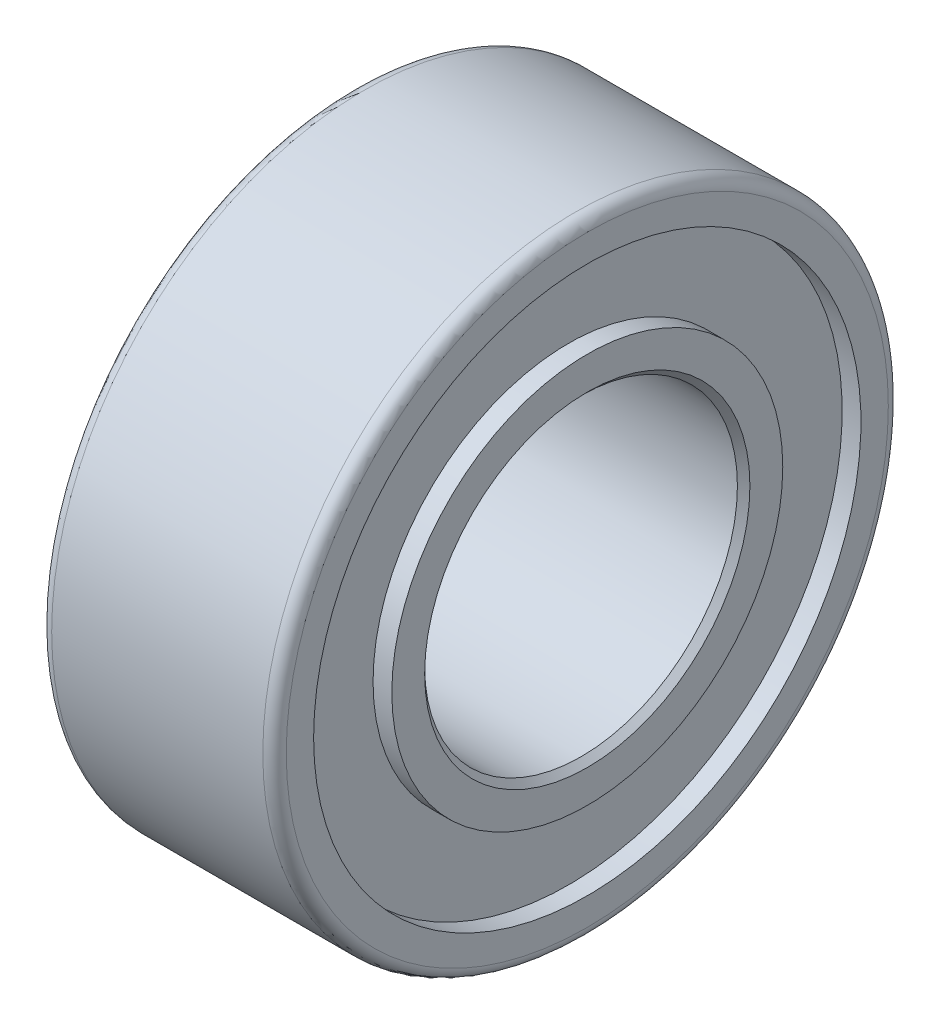
ISO-10303-21;
HEADER;
FILE_DESCRIPTION(('STEP AP214'),'2;1');
FILE_NAME('part.step','',(''),(''),'','','');
FILE_SCHEMA(('AUTOMOTIVE_DESIGN { 1 0 10303 214 1 1 1 1 }'));
ENDSEC;
DATA;
#1=APPLICATION_CONTEXT('core data for automotive mechanical design processes');
#2=APPLICATION_PROTOCOL_DEFINITION('international standard','automotive_design',2000,#1);
#3=PRODUCT_CONTEXT('',#1,'mechanical');
#4=PRODUCT('Part','Part','',(#3));
#5=PRODUCT_RELATED_PRODUCT_CATEGORY('part','',(#4));
#6=PRODUCT_DEFINITION_FORMATION('','',#4);
#7=PRODUCT_DEFINITION_CONTEXT('part definition',#1,'design');
#8=PRODUCT_DEFINITION('design','',#6,#7);
#9=PRODUCT_DEFINITION_SHAPE('','',#8);
#10=(LENGTH_UNIT() NAMED_UNIT(*) SI_UNIT(.MILLI.,.METRE.));
#11=(NAMED_UNIT(*) PLANE_ANGLE_UNIT() SI_UNIT($,.RADIAN.));
#12=(NAMED_UNIT(*) SI_UNIT($,.STERADIAN.) SOLID_ANGLE_UNIT());
#13=UNCERTAINTY_MEASURE_WITH_UNIT(LENGTH_MEASURE(1.E-05),#10,'distance_accuracy_value','');
#14=(GEOMETRIC_REPRESENTATION_CONTEXT(3) GLOBAL_UNCERTAINTY_ASSIGNED_CONTEXT((#13)) GLOBAL_UNIT_ASSIGNED_CONTEXT((#10,
#11,#12)) REPRESENTATION_CONTEXT('',''));
#15=CARTESIAN_POINT('',(0.,0.,0.));
#16=DIRECTION('',(0.,0.,1.));
#17=DIRECTION('',(1.,0.,0.));
#18=AXIS2_PLACEMENT_3D('',#15,#16,#17);
#19=CARTESIAN_POINT('',(0.,0.,0.));
#20=DIRECTION('',(-1.,0.,0.));
#21=DIRECTION('',(0.,0.,1.));
#22=AXIS2_PLACEMENT_3D('',#19,#20,#21);
#23=CYLINDRICAL_SURFACE('',#22,3.175);
#24=CARTESIAN_POINT('',(-2.25424999996449,0.,0.));
#25=DIRECTION('',(-1.,0.,0.));
#26=DIRECTION('',(0.,0.,1.));
#27=AXIS2_PLACEMENT_3D('',#24,#25,#26);
#28=CIRCLE('',#27,3.17499999999882);
#29=CARTESIAN_POINT('',(-2.25424999996449,0.,3.17499999999882));
#30=VERTEX_POINT('',#29);
#31=EDGE_CURVE('E64',#30,#30,#28,.T.);
#32=ORIENTED_EDGE('',*,*,#31,.T.);
#33=EDGE_LOOP('',(#32));
#34=FACE_BOUND('',#33,.T.);
#35=CARTESIAN_POINT('',(2.25425000002133,0.,0.));
#36=DIRECTION('',(1.,0.,0.));
#37=DIRECTION('',(0.,0.,-1.));
#38=AXIS2_PLACEMENT_3D('',#35,#36,#37);
#39=CIRCLE('',#38,3.17500000005566);
#40=CARTESIAN_POINT('',(2.25425000002133,0.,-3.17500000005566));
#41=VERTEX_POINT('',#40);
#42=EDGE_CURVE('E296',#41,#41,#39,.T.);
#43=ORIENTED_EDGE('',*,*,#42,.T.);
#44=EDGE_LOOP('',(#43));
#45=FACE_BOUND('',#44,.T.);
#46=ADVANCED_FACE('F16',(#34,#45),#23,.F.);
#47=CARTESIAN_POINT('',(2.38125000004175,0.,0.));
#48=DIRECTION('',(1.,0.,0.));
#49=DIRECTION('',(0.,0.,-1.));
#50=AXIS2_PLACEMENT_3D('',#47,#48,#49);
#51=CONICAL_SURFACE('',#50,3.30200000001923,0.785398163173655);
#52=CARTESIAN_POINT('',(2.38125000004175,0.,0.));
#53=DIRECTION('',(1.,0.,0.));
#54=DIRECTION('',(0.,0.,-1.));
#55=AXIS2_PLACEMENT_3D('',#52,#53,#54);
#56=CIRCLE('',#55,3.30200000001923);
#57=CARTESIAN_POINT('',(2.38125000004175,0.,-3.30200000001923));
#58=VERTEX_POINT('',#57);
#59=EDGE_CURVE('E318',#58,#58,#56,.T.);
#60=ORIENTED_EDGE('',*,*,#59,.T.);
#61=EDGE_LOOP('',(#60));
#62=FACE_BOUND('',#61,.T.);
#63=ORIENTED_EDGE('',*,*,#42,.F.);
#64=EDGE_LOOP('',(#63));
#65=FACE_BOUND('',#64,.T.);
#66=ADVANCED_FACE('F160',(#62,#65),#51,.F.);
#67=CARTESIAN_POINT('',(-2.38124999992806,0.,0.));
#68=DIRECTION('',(-1.,0.,0.));
#69=DIRECTION('',(0.,0.,1.));
#70=AXIS2_PLACEMENT_3D('',#67,#68,#69);
#71=CONICAL_SURFACE('',#70,3.30199999990555,0.785398163397448);
#72=CARTESIAN_POINT('',(-2.3812499999849,0.,0.));
#73=DIRECTION('',(-1.,0.,0.));
#74=DIRECTION('',(0.,0.,1.));
#75=AXIS2_PLACEMENT_3D('',#72,#73,#74);
#76=CIRCLE('',#75,3.30199999996239);
#77=CARTESIAN_POINT('',(-2.3812499999849,0.,3.30199999996239));
#78=VERTEX_POINT('',#77);
#79=EDGE_CURVE('E315',#78,#78,#76,.T.);
#80=ORIENTED_EDGE('',*,*,#79,.T.);
#81=EDGE_LOOP('',(#80));
#82=FACE_BOUND('',#81,.T.);
#83=ORIENTED_EDGE('',*,*,#31,.F.);
#84=EDGE_LOOP('',(#83));
#85=FACE_BOUND('',#84,.T.);
#86=ADVANCED_FACE('F157',(#82,#85),#71,.F.);
#87=CARTESIAN_POINT('',(2.38125,3.175,0.));
#88=DIRECTION('',(-1.,0.,0.));
#89=DIRECTION('',(0.,0.,1.));
#90=AXIS2_PLACEMENT_3D('',#87,#88,#89);
#91=PLANE('',#90);
#92=CARTESIAN_POINT('',(2.38125,0.,0.));
#93=DIRECTION('',(-1.,0.,0.));
#94=DIRECTION('',(0.,0.,1.));
#95=AXIS2_PLACEMENT_3D('',#92,#93,#94);
#96=CIRCLE('',#95,3.96875);
#97=CARTESIAN_POINT('',(2.38125,0.,3.96875));
#98=VERTEX_POINT('',#97);
#99=EDGE_CURVE('E312',#98,#98,#96,.T.);
#100=ORIENTED_EDGE('',*,*,#99,.F.);
#101=EDGE_LOOP('',(#100));
#102=FACE_BOUND('',#101,.T.);
#103=ORIENTED_EDGE('',*,*,#59,.F.);
#104=EDGE_LOOP('',(#103));
#105=FACE_BOUND('',#104,.T.);
#106=ADVANCED_FACE('F153',(#102,#105),#91,.F.);
#107=CARTESIAN_POINT('',(-2.38125,3.96875,0.));
#108=DIRECTION('',(1.,0.,0.));
#109=DIRECTION('',(0.,0.,-1.));
#110=AXIS2_PLACEMENT_3D('',#107,#108,#109);
#111=PLANE('',#110);
#112=CARTESIAN_POINT('',(-2.38125,0.,0.));
#113=DIRECTION('',(-1.,0.,0.));
#114=DIRECTION('',(0.,0.,1.));
#115=AXIS2_PLACEMENT_3D('',#112,#113,#114);
#116=CIRCLE('',#115,3.96875);
#117=CARTESIAN_POINT('',(-2.38125,0.,3.96875));
#118=VERTEX_POINT('',#117);
#119=EDGE_CURVE('E309',#118,#118,#116,.F.);
#120=ORIENTED_EDGE('',*,*,#119,.F.);
#121=EDGE_LOOP('',(#120));
#122=FACE_BOUND('',#121,.T.);
#123=ORIENTED_EDGE('',*,*,#79,.F.);
#124=EDGE_LOOP('',(#123));
#125=FACE_BOUND('',#124,.T.);
#126=ADVANCED_FACE('F149',(#122,#125),#111,.F.);
#127=CARTESIAN_POINT('',(0.,0.,0.));
#128=DIRECTION('',(-1.,0.,0.));
#129=DIRECTION('',(0.,0.,1.));
#130=AXIS2_PLACEMENT_3D('',#127,#128,#129);
#131=CYLINDRICAL_SURFACE('',#130,3.96875);
#132=CARTESIAN_POINT('',(2.00025,0.,0.));
#133=DIRECTION('',(-1.,0.,0.));
#134=DIRECTION('',(0.,0.,1.));
#135=AXIS2_PLACEMENT_3D('',#132,#133,#134);
#136=CIRCLE('',#135,3.96875);
#137=CARTESIAN_POINT('',(2.00025,0.,3.96875));
#138=VERTEX_POINT('',#137);
#139=EDGE_CURVE('E306',#138,#138,#136,.F.);
#140=ORIENTED_EDGE('',*,*,#139,.T.);
#141=EDGE_LOOP('',(#140));
#142=FACE_BOUND('',#141,.T.);
#143=ORIENTED_EDGE('',*,*,#99,.T.);
#144=EDGE_LOOP('',(#143));
#145=FACE_BOUND('',#144,.T.);
#146=ADVANCED_FACE('F145',(#142,#145),#131,.T.);
#147=CARTESIAN_POINT('',(0.,0.,0.));
#148=DIRECTION('',(-1.,0.,0.));
#149=DIRECTION('',(0.,0.,1.));
#150=AXIS2_PLACEMENT_3D('',#147,#148,#149);
#151=CYLINDRICAL_SURFACE('',#150,3.96875);
#152=ORIENTED_EDGE('',*,*,#119,.T.);
#153=EDGE_LOOP('',(#152));
#154=FACE_BOUND('',#153,.T.);
#155=CARTESIAN_POINT('',(-2.00025,0.,0.));
#156=DIRECTION('',(-1.,0.,0.));
#157=DIRECTION('',(0.,0.,1.));
#158=AXIS2_PLACEMENT_3D('',#155,#156,#157);
#159=CIRCLE('',#158,3.96875);
#160=CARTESIAN_POINT('',(-2.00025,0.,3.96875));
#161=VERTEX_POINT('',#160);
#162=EDGE_CURVE('E303',#161,#161,#159,.T.);
#163=ORIENTED_EDGE('',*,*,#162,.T.);
#164=EDGE_LOOP('',(#163));
#165=FACE_BOUND('',#164,.T.);
#166=ADVANCED_FACE('F141',(#154,#165),#151,.T.);
#167=CARTESIAN_POINT('',(2.00025,3.96875,0.));
#168=DIRECTION('',(-1.,0.,0.));
#169=DIRECTION('',(0.,0.,1.));
#170=AXIS2_PLACEMENT_3D('',#167,#168,#169);
#171=PLANE('',#170);
#172=ORIENTED_EDGE('',*,*,#139,.F.);
#173=EDGE_LOOP('',(#172));
#174=FACE_BOUND('',#173,.T.);
#175=CARTESIAN_POINT('',(2.00025,0.,0.));
#176=DIRECTION('',(-1.,0.,0.));
#177=DIRECTION('',(0.,0.,1.));
#178=AXIS2_PLACEMENT_3D('',#175,#176,#177);
#179=CIRCLE('',#178,5.55625);
#180=CARTESIAN_POINT('',(2.00025,0.,5.55625));
#181=VERTEX_POINT('',#180);
#182=EDGE_CURVE('E300',#181,#181,#179,.F.);
#183=ORIENTED_EDGE('',*,*,#182,.T.);
#184=EDGE_LOOP('',(#183));
#185=FACE_BOUND('',#184,.T.);
#186=ADVANCED_FACE('F137',(#174,#185),#171,.F.);
#187=CARTESIAN_POINT('',(-2.00025,5.55625,0.));
#188=DIRECTION('',(1.,0.,0.));
#189=DIRECTION('',(0.,0.,-1.));
#190=AXIS2_PLACEMENT_3D('',#187,#188,#189);
#191=PLANE('',#190);
#192=CARTESIAN_POINT('',(-2.00025,0.,0.));
#193=DIRECTION('',(-1.,0.,0.));
#194=DIRECTION('',(0.,0.,1.));
#195=AXIS2_PLACEMENT_3D('',#192,#193,#194);
#196=CIRCLE('',#195,5.55625);
#197=CARTESIAN_POINT('',(-2.00025,0.,5.55625));
#198=VERTEX_POINT('',#197);
#199=EDGE_CURVE('E294',#198,#198,#196,.T.);
#200=ORIENTED_EDGE('',*,*,#199,.T.);
#201=EDGE_LOOP('',(#200));
#202=FACE_BOUND('',#201,.T.);
#203=ORIENTED_EDGE('',*,*,#162,.F.);
#204=EDGE_LOOP('',(#203));
#205=FACE_BOUND('',#204,.T.);
#206=ADVANCED_FACE('F133',(#202,#205),#191,.F.);
#207=CARTESIAN_POINT('',(0.,0.,0.));
#208=DIRECTION('',(-1.,0.,0.));
#209=DIRECTION('',(0.,0.,1.));
#210=AXIS2_PLACEMENT_3D('',#207,#208,#209);
#211=CYLINDRICAL_SURFACE('',#210,5.55625);
#212=CARTESIAN_POINT('',(2.38125,0.,0.));
#213=DIRECTION('',(-1.,0.,0.));
#214=DIRECTION('',(0.,0.,1.));
#215=AXIS2_PLACEMENT_3D('',#212,#213,#214);
#216=CIRCLE('',#215,5.55625);
#217=CARTESIAN_POINT('',(2.38125,0.,5.55625));
#218=VERTEX_POINT('',#217);
#219=EDGE_CURVE('E291',#218,#218,#216,.F.);
#220=ORIENTED_EDGE('',*,*,#219,.T.);
#221=EDGE_LOOP('',(#220));
#222=FACE_BOUND('',#221,.T.);
#223=ORIENTED_EDGE('',*,*,#182,.F.);
#224=EDGE_LOOP('',(#223));
#225=FACE_BOUND('',#224,.T.);
#226=ADVANCED_FACE('F129',(#222,#225),#211,.F.);
#227=CARTESIAN_POINT('',(0.,0.,0.));
#228=DIRECTION('',(-1.,0.,0.));
#229=DIRECTION('',(0.,0.,1.));
#230=AXIS2_PLACEMENT_3D('',#227,#228,#229);
#231=CYLINDRICAL_SURFACE('',#230,5.55625);
#232=ORIENTED_EDGE('',*,*,#199,.F.);
#233=EDGE_LOOP('',(#232));
#234=FACE_BOUND('',#233,.T.);
#235=CARTESIAN_POINT('',(-2.38125,0.,0.));
#236=DIRECTION('',(-1.,0.,0.));
#237=DIRECTION('',(0.,0.,1.));
#238=AXIS2_PLACEMENT_3D('',#235,#236,#237);
#239=CIRCLE('',#238,5.55625);
#240=CARTESIAN_POINT('',(-2.38125,0.,5.55625));
#241=VERTEX_POINT('',#240);
#242=EDGE_CURVE('E51',#241,#241,#239,.T.);
#243=ORIENTED_EDGE('',*,*,#242,.T.);
#244=EDGE_LOOP('',(#243));
#245=FACE_BOUND('',#244,.T.);
#246=ADVANCED_FACE('F124',(#234,#245),#231,.F.);
#247=CARTESIAN_POINT('',(2.38125,5.55625,0.));
#248=DIRECTION('',(-1.,0.,0.));
#249=DIRECTION('',(0.,0.,1.));
#250=AXIS2_PLACEMENT_3D('',#247,#248,#249);
#251=PLANE('',#250);
#252=ORIENTED_EDGE('',*,*,#219,.F.);
#253=EDGE_LOOP('',(#252));
#254=FACE_BOUND('',#253,.T.);
#255=CARTESIAN_POINT('',(2.38125,0.,0.));
#256=DIRECTION('',(-1.,0.,0.));
#257=DIRECTION('',(0.,0.,1.));
#258=AXIS2_PLACEMENT_3D('',#255,#256,#257);
#259=CIRCLE('',#258,6.111875);
#260=CARTESIAN_POINT('',(2.38125,0.,6.111875));
#261=VERTEX_POINT('',#260);
#262=CARTESIAN_POINT('',(2.38125,0.,-6.111875));
#263=VERTEX_POINT('',#262);
#264=EDGE_CURVE('E44',#261,#263,#259,.T.);
#265=ORIENTED_EDGE('',*,*,#264,.F.);
#266=CARTESIAN_POINT('',(2.38125,0.,0.));
#267=DIRECTION('',(-1.,0.,0.));
#268=DIRECTION('',(0.,0.,-1.));
#269=AXIS2_PLACEMENT_3D('',#266,#267,#268);
#270=CIRCLE('',#269,6.111875);
#271=EDGE_CURVE('E47',#263,#261,#270,.T.);
#272=ORIENTED_EDGE('',*,*,#271,.F.);
#273=EDGE_LOOP('',(#265,#272));
#274=FACE_BOUND('',#273,.T.);
#275=ADVANCED_FACE('F49',(#254,#274),#251,.F.);
#276=CARTESIAN_POINT('',(-2.38125,6.35,0.));
#277=DIRECTION('',(1.,0.,0.));
#278=DIRECTION('',(0.,0.,-1.));
#279=AXIS2_PLACEMENT_3D('',#276,#277,#278);
#280=PLANE('',#279);
#281=ORIENTED_EDGE('',*,*,#242,.F.);
#282=EDGE_LOOP('',(#281));
#283=FACE_BOUND('',#282,.T.);
#284=CARTESIAN_POINT('',(-2.38125,0.,0.));
#285=DIRECTION('',(1.,0.,0.));
#286=DIRECTION('',(0.,0.,-1.));
#287=AXIS2_PLACEMENT_3D('',#284,#285,#286);
#288=CIRCLE('',#287,6.111875);
#289=CARTESIAN_POINT('',(-2.38125,0.,-6.111875));
#290=VERTEX_POINT('',#289);
#291=CARTESIAN_POINT('',(-2.38125,0.,6.111875));
#292=VERTEX_POINT('',#291);
#293=EDGE_CURVE('E56',#290,#292,#288,.T.);
#294=ORIENTED_EDGE('',*,*,#293,.F.);
#295=CARTESIAN_POINT('',(-2.38125,0.,0.));
#296=DIRECTION('',(1.,0.,0.));
#297=DIRECTION('',(0.,0.,1.));
#298=AXIS2_PLACEMENT_3D('',#295,#296,#297);
#299=CIRCLE('',#298,6.111875);
#300=EDGE_CURVE('E35',#292,#290,#299,.T.);
#301=ORIENTED_EDGE('',*,*,#300,.F.);
#302=EDGE_LOOP('',(#294,#301));
#303=FACE_BOUND('',#302,.T.);
#304=ADVANCED_FACE('F77',(#283,#303),#280,.F.);
#305=CARTESIAN_POINT('',(2.143125,0.,0.));
#306=DIRECTION('',(-1.,0.,0.));
#307=DIRECTION('',(0.,0.,1.));
#308=AXIS2_PLACEMENT_3D('',#305,#306,#307);
#309=TOROIDAL_SURFACE('',#308,6.111875,0.238125);
#310=CARTESIAN_POINT('',(2.143125,0.,0.));
#311=DIRECTION('',(-1.,0.,0.));
#312=DIRECTION('',(0.,0.,1.));
#313=AXIS2_PLACEMENT_3D('',#310,#311,#312);
#314=CIRCLE('',#313,6.35);
#315=CARTESIAN_POINT('',(2.143125,0.,6.35));
#316=VERTEX_POINT('',#315);
#317=EDGE_CURVE('E27',#316,#316,#314,.T.);
#318=ORIENTED_EDGE('',*,*,#317,.F.);
#319=EDGE_LOOP('',(#318));
#320=FACE_BOUND('',#319,.T.);
#321=ORIENTED_EDGE('',*,*,#264,.T.);
#322=ORIENTED_EDGE('',*,*,#271,.T.);
#323=EDGE_LOOP('',(#321,#322));
#324=FACE_BOUND('',#323,.T.);
#325=ADVANCED_FACE('F55',(#320,#324),#309,.T.);
#326=CARTESIAN_POINT('',(-2.143125,0.,0.));
#327=DIRECTION('',(1.,0.,0.));
#328=DIRECTION('',(0.,0.,-1.));
#329=AXIS2_PLACEMENT_3D('',#326,#327,#328);
#330=TOROIDAL_SURFACE('',#329,6.111875,0.238125);
#331=CARTESIAN_POINT('',(-2.143125,0.,0.));
#332=DIRECTION('',(-1.,0.,0.));
#333=DIRECTION('',(0.,0.,1.));
#334=AXIS2_PLACEMENT_3D('',#331,#332,#333);
#335=CIRCLE('',#334,6.35);
#336=CARTESIAN_POINT('',(-2.143125,0.,6.35));
#337=VERTEX_POINT('',#336);
#338=EDGE_CURVE('E11',#337,#337,#335,.F.);
#339=ORIENTED_EDGE('',*,*,#338,.F.);
#340=EDGE_LOOP('',(#339));
#341=FACE_BOUND('',#340,.T.);
#342=ORIENTED_EDGE('',*,*,#293,.T.);
#343=ORIENTED_EDGE('',*,*,#300,.T.);
#344=EDGE_LOOP('',(#342,#343));
#345=FACE_BOUND('',#344,.T.);
#346=ADVANCED_FACE('F76',(#341,#345),#330,.T.);
#347=CARTESIAN_POINT('',(0.,0.,0.));
#348=DIRECTION('',(-1.,0.,0.));
#349=DIRECTION('',(0.,0.,1.));
#350=AXIS2_PLACEMENT_3D('',#347,#348,#349);
#351=CYLINDRICAL_SURFACE('',#350,6.35);
#352=ORIENTED_EDGE('',*,*,#338,.T.);
#353=EDGE_LOOP('',(#352));
#354=FACE_BOUND('',#353,.T.);
#355=ORIENTED_EDGE('',*,*,#317,.T.);
#356=EDGE_LOOP('',(#355));
#357=FACE_BOUND('',#356,.T.);
#358=ADVANCED_FACE('F172',(#354,#357),#351,.T.);
#359=CLOSED_SHELL('',(#46,#66,#86,#106,#126,#146,#166,#186,#206,#226,#246,#275,#304,#325,#346,#358));
#360=MANIFOLD_SOLID_BREP('B1',#359);
#361=ADVANCED_BREP_SHAPE_REPRESENTATION('',(#18,#360),#14);
#362=SHAPE_DEFINITION_REPRESENTATION(#9,#361);
ENDSEC;
END-ISO-10303-21;
